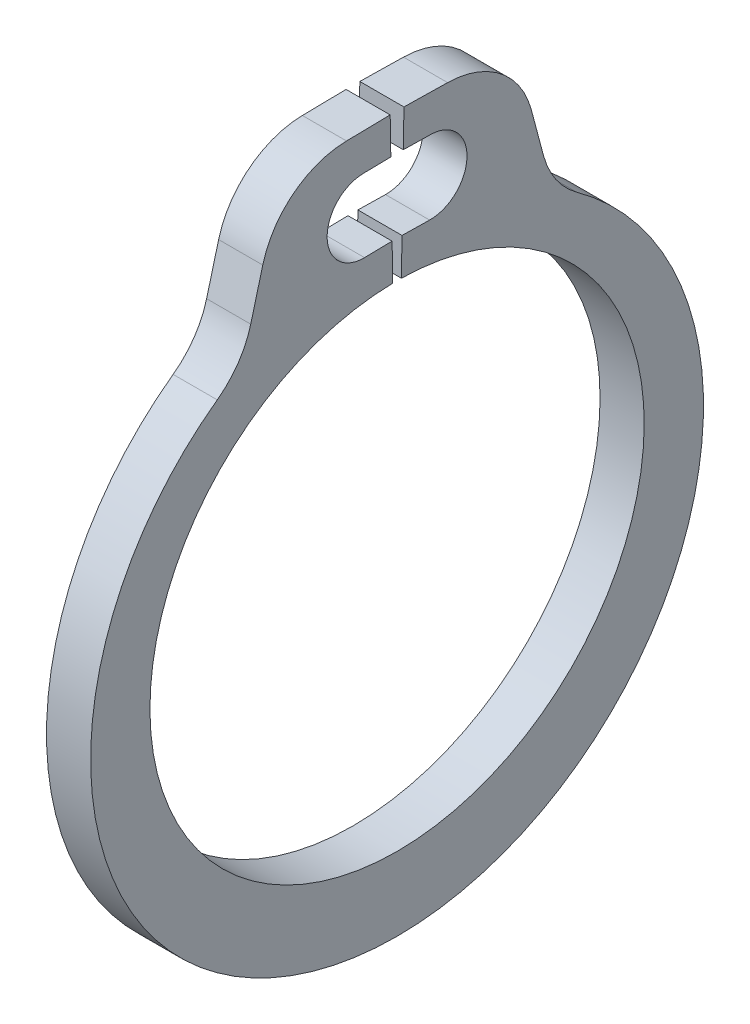
ISO-10303-21;
HEADER;
FILE_DESCRIPTION(('STEP AP214'),'2;1');
FILE_NAME('part.step','',(''),(''),'','','');
FILE_SCHEMA(('AUTOMOTIVE_DESIGN { 1 0 10303 214 1 1 1 1 }'));
ENDSEC;
DATA;
#1=APPLICATION_CONTEXT('core data for automotive mechanical design processes');
#2=APPLICATION_PROTOCOL_DEFINITION('international standard','automotive_design',2000,#1);
#3=PRODUCT_CONTEXT('',#1,'mechanical');
#4=PRODUCT('Part','Part','',(#3));
#5=PRODUCT_RELATED_PRODUCT_CATEGORY('part','',(#4));
#6=PRODUCT_DEFINITION_FORMATION('','',#4);
#7=PRODUCT_DEFINITION_CONTEXT('part definition',#1,'design');
#8=PRODUCT_DEFINITION('design','',#6,#7);
#9=PRODUCT_DEFINITION_SHAPE('','',#8);
#10=(LENGTH_UNIT() NAMED_UNIT(*) SI_UNIT(.MILLI.,.METRE.));
#11=(NAMED_UNIT(*) PLANE_ANGLE_UNIT() SI_UNIT($,.RADIAN.));
#12=(NAMED_UNIT(*) SI_UNIT($,.STERADIAN.) SOLID_ANGLE_UNIT());
#13=UNCERTAINTY_MEASURE_WITH_UNIT(LENGTH_MEASURE(1.E-05),#10,'distance_accuracy_value','');
#14=(GEOMETRIC_REPRESENTATION_CONTEXT(3) GLOBAL_UNCERTAINTY_ASSIGNED_CONTEXT((#13)) GLOBAL_UNIT_ASSIGNED_CONTEXT((#10,
#11,#12)) REPRESENTATION_CONTEXT('',''));
#15=CARTESIAN_POINT('',(0.,0.,0.));
#16=DIRECTION('',(0.,0.,1.));
#17=DIRECTION('',(1.,0.,0.));
#18=AXIS2_PLACEMENT_3D('',#15,#16,#17);
#19=CARTESIAN_POINT('',(0.1905,0.,0.));
#20=DIRECTION('',(-1.,0.,0.));
#21=DIRECTION('',(0.,0.,1.));
#22=AXIS2_PLACEMENT_3D('',#19,#20,#21);
#23=CYLINDRICAL_SURFACE('',#22,2.1336);
#24=CARTESIAN_POINT('',(-0.1905,0.,0.));
#25=DIRECTION('',(-1.,0.,0.));
#26=DIRECTION('',(0.,0.,-1.));
#27=AXIS2_PLACEMENT_3D('',#24,#25,#26);
#28=CIRCLE('',#27,2.1336);
#29=CARTESIAN_POINT('',(-0.1905,2.13327504238568,-0.0372364543745881));
#30=VERTEX_POINT('',#29);
#31=CARTESIAN_POINT('',(-0.1905,2.13327504238568,0.0372364543745881));
#32=VERTEX_POINT('',#31);
#33=EDGE_CURVE('E196',#30,#32,#28,.T.);
#34=ORIENTED_EDGE('',*,*,#33,.T.);
#35=DIRECTION('',(-1.,0.,0.));
#36=VECTOR('',#35,1.);
#37=CARTESIAN_POINT('',(0.1905,2.13327504238568,0.0372364543745881));
#38=LINE('',#37,#36);
#39=CARTESIAN_POINT('',(0.1905,2.13327504238568,0.0372364543745881));
#40=VERTEX_POINT('',#39);
#41=EDGE_CURVE('E178',#40,#32,#38,.T.);
#42=ORIENTED_EDGE('',*,*,#41,.F.);
#43=CARTESIAN_POINT('',(0.1905,0.,0.));
#44=DIRECTION('',(-1.,0.,0.));
#45=DIRECTION('',(0.,0.,-1.));
#46=AXIS2_PLACEMENT_3D('',#43,#44,#45);
#47=CIRCLE('',#46,2.1336);
#48=CARTESIAN_POINT('',(0.1905,2.13327504238568,-0.0372364543745881));
#49=VERTEX_POINT('',#48);
#50=EDGE_CURVE('E184',#49,#40,#47,.T.);
#51=ORIENTED_EDGE('',*,*,#50,.F.);
#52=DIRECTION('',(-1.,0.,0.));
#53=VECTOR('',#52,1.);
#54=CARTESIAN_POINT('',(0.1905,2.13327504238568,-0.0372364543745881));
#55=LINE('',#54,#53);
#56=EDGE_CURVE('E274',#49,#30,#55,.T.);
#57=ORIENTED_EDGE('',*,*,#56,.T.);
#58=EDGE_LOOP('',(#34,#42,#51,#57));
#59=FACE_BOUND('',#58,.T.);
#60=ADVANCED_FACE('F35',(#59),#23,.F.);
#61=CARTESIAN_POINT('',(0.1905,2.45072668559783,0.0427775934184257));
#62=DIRECTION('',(0.,-0.0174524064372838,0.999847695156391));
#63=DIRECTION('',(0.,-0.999847695156391,-0.0174524064372838));
#64=AXIS2_PLACEMENT_3D('',#61,#62,#63);
#65=PLANE('',#64);
#66=DIRECTION('',(0.,0.999847695156391,0.0174524064372838));
#67=VECTOR('',#66,1.);
#68=CARTESIAN_POINT('',(-0.1905,2.45072668559783,0.0427775934184257));
#69=LINE('',#68,#67);
#70=CARTESIAN_POINT('',(-0.1905,2.45072668559783,0.0427775934184257));
#71=VERTEX_POINT('',#70);
#72=EDGE_CURVE('E276',#32,#71,#69,.T.);
#73=ORIENTED_EDGE('',*,*,#72,.T.);
#74=DIRECTION('',(-1.,0.,0.));
#75=VECTOR('',#74,1.);
#76=CARTESIAN_POINT('',(0.1905,2.45072668559783,0.0427775934184257));
#77=LINE('',#76,#75);
#78=CARTESIAN_POINT('',(0.1905,2.45072668559783,0.0427775934184257));
#79=VERTEX_POINT('',#78);
#80=EDGE_CURVE('E181',#79,#71,#77,.T.);
#81=ORIENTED_EDGE('',*,*,#80,.F.);
#82=DIRECTION('',(0.,0.999847695156391,0.0174524064372838));
#83=VECTOR('',#82,1.);
#84=CARTESIAN_POINT('',(0.1905,2.45072668559783,0.0427775934184257));
#85=LINE('',#84,#83);
#86=EDGE_CURVE('E174',#40,#79,#85,.T.);
#87=ORIENTED_EDGE('',*,*,#86,.F.);
#88=ORIENTED_EDGE('',*,*,#41,.T.);
#89=EDGE_LOOP('',(#73,#81,#87,#88));
#90=FACE_BOUND('',#89,.T.);
#91=ADVANCED_FACE('F176',(#90),#65,.F.);
#92=CARTESIAN_POINT('',(0.1905,2.45072668559783,0.0427775934184257));
#93=DIRECTION('',(0.,-0.999847695156391,-0.0174524064372829));
#94=DIRECTION('',(0.,0.0174524064372829,-0.999847695156391));
#95=AXIS2_PLACEMENT_3D('',#92,#93,#94);
#96=PLANE('',#95);
#97=DIRECTION('',(0.,-0.0174524064372829,0.999847695156391));
#98=VECTOR('',#97,1.);
#99=CARTESIAN_POINT('',(-0.1905,2.45072668559783,0.0427775934184257));
#100=LINE('',#99,#98);
#101=CARTESIAN_POINT('',(-0.1905,2.44657083131495,0.280866325827541));
#102=VERTEX_POINT('',#101);
#103=EDGE_CURVE('E278',#71,#102,#100,.T.);
#104=ORIENTED_EDGE('',*,*,#103,.T.);
#105=DIRECTION('',(-1.,0.,0.));
#106=VECTOR('',#105,1.);
#107=CARTESIAN_POINT('',(0.1905,2.44657083131495,0.280866325827541));
#108=LINE('',#107,#106);
#109=CARTESIAN_POINT('',(0.1905,2.44657083131495,0.280866325827541));
#110=VERTEX_POINT('',#109);
#111=EDGE_CURVE('E201',#110,#102,#108,.T.);
#112=ORIENTED_EDGE('',*,*,#111,.F.);
#113=DIRECTION('',(0.,-0.0174524064372829,0.999847695156391));
#114=VECTOR('',#113,1.);
#115=CARTESIAN_POINT('',(0.1905,2.45072668559783,0.0427775934184257));
#116=LINE('',#115,#114);
#117=EDGE_CURVE('E183',#79,#110,#116,.T.);
#118=ORIENTED_EDGE('',*,*,#117,.F.);
#119=ORIENTED_EDGE('',*,*,#80,.T.);
#120=EDGE_LOOP('',(#104,#112,#118,#119));
#121=FACE_BOUND('',#120,.T.);
#122=ADVANCED_FACE('F380',(#121),#96,.F.);
#123=CARTESIAN_POINT('',(0.1905,2.76402247452711,0.286407464871378));
#124=DIRECTION('',(-1.,0.,0.));
#125=DIRECTION('',(0.,0.,1.));
#126=AXIS2_PLACEMENT_3D('',#123,#124,#125);
#127=CYLINDRICAL_SURFACE('',#126,0.3175);
#128=CARTESIAN_POINT('',(-0.1905,2.76402247452711,0.286407464871378));
#129=DIRECTION('',(-1.,0.,0.));
#130=DIRECTION('',(0.,0.,1.));
#131=AXIS2_PLACEMENT_3D('',#128,#129,#130);
#132=CIRCLE('',#131,0.3175);
#133=CARTESIAN_POINT('',(-0.1905,3.08147411773926,0.291948603915216));
#134=VERTEX_POINT('',#133);
#135=EDGE_CURVE('E280',#102,#134,#132,.T.);
#136=ORIENTED_EDGE('',*,*,#135,.T.);
#137=DIRECTION('',(-1.,0.,0.));
#138=VECTOR('',#137,1.);
#139=CARTESIAN_POINT('',(0.1905,3.08147411773926,0.291948603915216));
#140=LINE('',#139,#138);
#141=CARTESIAN_POINT('',(0.1905,3.08147411773926,0.291948603915216));
#142=VERTEX_POINT('',#141);
#143=EDGE_CURVE('E324',#142,#134,#140,.T.);
#144=ORIENTED_EDGE('',*,*,#143,.F.);
#145=CARTESIAN_POINT('',(0.1905,2.76402247452711,0.286407464871378));
#146=DIRECTION('',(-1.,0.,0.));
#147=DIRECTION('',(0.,0.,1.));
#148=AXIS2_PLACEMENT_3D('',#145,#146,#147);
#149=CIRCLE('',#148,0.3175);
#150=EDGE_CURVE('E333',#110,#142,#149,.T.);
#151=ORIENTED_EDGE('',*,*,#150,.F.);
#152=ORIENTED_EDGE('',*,*,#111,.T.);
#153=EDGE_LOOP('',(#136,#144,#151,#152));
#154=FACE_BOUND('',#153,.T.);
#155=ADVANCED_FACE('F331',(#154),#127,.F.);
#156=CARTESIAN_POINT('',(0.1905,3.08562997202214,0.0538598715061008));
#157=DIRECTION('',(0.,0.999847695156391,0.0174524064372829));
#158=DIRECTION('',(0.,-0.0174524064372829,0.999847695156391));
#159=AXIS2_PLACEMENT_3D('',#156,#157,#158);
#160=PLANE('',#159);
#161=DIRECTION('',(0.,0.0174524064372829,-0.999847695156391));
#162=VECTOR('',#161,1.);
#163=CARTESIAN_POINT('',(-0.1905,3.08562997202214,0.0538598715061008));
#164=LINE('',#163,#162);
#165=CARTESIAN_POINT('',(-0.1905,3.08562997202214,0.0538598715061008));
#166=VERTEX_POINT('',#165);
#167=EDGE_CURVE('E282',#134,#166,#164,.T.);
#168=ORIENTED_EDGE('',*,*,#167,.T.);
#169=DIRECTION('',(-1.,0.,0.));
#170=VECTOR('',#169,1.);
#171=CARTESIAN_POINT('',(0.1905,3.08562997202214,0.0538598715061008));
#172=LINE('',#171,#170);
#173=CARTESIAN_POINT('',(0.1905,3.08562997202214,0.0538598715061008));
#174=VERTEX_POINT('',#173);
#175=EDGE_CURVE('E321',#174,#166,#172,.T.);
#176=ORIENTED_EDGE('',*,*,#175,.F.);
#177=DIRECTION('',(0.,0.0174524064372829,-0.999847695156391));
#178=VECTOR('',#177,1.);
#179=CARTESIAN_POINT('',(0.1905,3.08562997202214,0.0538598715061008));
#180=LINE('',#179,#178);
#181=EDGE_CURVE('E349',#142,#174,#180,.T.);
#182=ORIENTED_EDGE('',*,*,#181,.F.);
#183=ORIENTED_EDGE('',*,*,#143,.T.);
#184=EDGE_LOOP('',(#168,#176,#182,#183));
#185=FACE_BOUND('',#184,.T.);
#186=ADVANCED_FACE('F341',(#185),#160,.F.);
#187=CARTESIAN_POINT('',(0.1905,3.08562997202214,0.0538598715061008));
#188=DIRECTION('',(0.,-0.0174524064372832,0.999847695156391));
#189=DIRECTION('',(0.,-0.999847695156391,-0.0174524064372832));
#190=AXIS2_PLACEMENT_3D('',#187,#188,#189);
#191=PLANE('',#190);
#192=DIRECTION('',(0.,0.999847695156391,0.0174524064372832));
#193=VECTOR('',#192,1.);
#194=CARTESIAN_POINT('',(-0.1905,3.08562997202214,0.0538598715061008));
#195=LINE('',#194,#193);
#196=CARTESIAN_POINT('',(-0.1905,3.40308161523429,0.0594010105499382));
#197=VERTEX_POINT('',#196);
#198=EDGE_CURVE('E284',#166,#197,#195,.T.);
#199=ORIENTED_EDGE('',*,*,#198,.T.);
#200=DIRECTION('',(-1.,0.,0.));
#201=VECTOR('',#200,1.);
#202=CARTESIAN_POINT('',(0.1905,3.40308161523429,0.0594010105499382));
#203=LINE('',#202,#201);
#204=CARTESIAN_POINT('',(0.1905,3.40308161523429,0.0594010105499382));
#205=VERTEX_POINT('',#204);
#206=EDGE_CURVE('E318',#205,#197,#203,.T.);
#207=ORIENTED_EDGE('',*,*,#206,.F.);
#208=DIRECTION('',(0.,0.999847695156391,0.0174524064372832));
#209=VECTOR('',#208,1.);
#210=CARTESIAN_POINT('',(0.1905,3.08562997202214,0.0538598715061008));
#211=LINE('',#210,#209);
#212=EDGE_CURVE('E347',#174,#205,#211,.T.);
#213=ORIENTED_EDGE('',*,*,#212,.F.);
#214=ORIENTED_EDGE('',*,*,#175,.T.);
#215=EDGE_LOOP('',(#199,#207,#213,#214));
#216=FACE_BOUND('',#215,.T.);
#217=ADVANCED_FACE('F345',(#216),#191,.F.);
#218=CARTESIAN_POINT('',(0.1905,3.40308161523429,0.0594010105499382));
#219=DIRECTION('',(0.,-0.999847695156391,-0.0174524064372833));
#220=DIRECTION('',(0.,0.0174524064372833,-0.999847695156391));
#221=AXIS2_PLACEMENT_3D('',#218,#219,#220);
#222=PLANE('',#221);
#223=DIRECTION('',(0.,-0.0174524064372833,0.999847695156391));
#224=VECTOR('',#223,1.);
#225=CARTESIAN_POINT('',(-0.1905,3.40308161523429,0.0594010105499382));
#226=LINE('',#225,#224);
#227=CARTESIAN_POINT('',(-0.1905,3.39650096805663,0.436406034863774));
#228=VERTEX_POINT('',#227);
#229=EDGE_CURVE('E286',#197,#228,#226,.T.);
#230=ORIENTED_EDGE('',*,*,#229,.T.);
#231=DIRECTION('',(-1.,0.,0.));
#232=VECTOR('',#231,1.);
#233=CARTESIAN_POINT('',(0.1905,3.39650096805663,0.436406034863774));
#234=LINE('',#233,#232);
#235=CARTESIAN_POINT('',(0.1905,3.39650096805663,0.436406034863774));
#236=VERTEX_POINT('',#235);
#237=EDGE_CURVE('E58',#228,#236,#234,.F.);
#238=ORIENTED_EDGE('',*,*,#237,.T.);
#239=DIRECTION('',(0.,-0.0174524064372833,0.999847695156391));
#240=VECTOR('',#239,1.);
#241=CARTESIAN_POINT('',(0.1905,3.40308161523429,0.0594010105499382));
#242=LINE('',#241,#240);
#243=EDGE_CURVE('E348',#205,#236,#242,.T.);
#244=ORIENTED_EDGE('',*,*,#243,.F.);
#245=ORIENTED_EDGE('',*,*,#206,.T.);
#246=EDGE_LOOP('',(#230,#238,#244,#245));
#247=FACE_BOUND('',#246,.T.);
#248=ADVANCED_FACE('F366',(#247),#222,.F.);
#249=CARTESIAN_POINT('',(0.1905,3.38645819810278,1.0117559401864));
#250=DIRECTION('',(0.,-0.256832135818306,-0.966456027975928));
#251=DIRECTION('',(0.,0.966456027975928,-0.256832135818306));
#252=AXIS2_PLACEMENT_3D('',#249,#250,#251);
#253=PLANE('',#252);
#254=DIRECTION('',(0.,-0.966456027975928,0.256832135818306));
#255=VECTOR('',#254,1.);
#256=CARTESIAN_POINT('',(-0.1905,3.38645819810278,1.0117559401864));
#257=LINE('',#256,#255);
#258=CARTESIAN_POINT('',(-0.1905,2.83032311184101,1.15954679447622));
#259=VERTEX_POINT('',#258);
#260=CARTESIAN_POINT('',(-0.1905,2.44016753972551,1.26322920318104));
#261=VERTEX_POINT('',#260);
#262=EDGE_CURVE('E248',#259,#261,#257,.T.);
#263=ORIENTED_EDGE('',*,*,#262,.T.);
#264=DIRECTION('',(1.,0.,0.));
#265=VECTOR('',#264,1.);
#266=CARTESIAN_POINT('',(0.1905,2.44016753972551,1.26322920318104));
#267=LINE('',#266,#265);
#268=CARTESIAN_POINT('',(0.1905,2.44016753972551,1.26322920318104));
#269=VERTEX_POINT('',#268);
#270=EDGE_CURVE('E210',#261,#269,#267,.T.);
#271=ORIENTED_EDGE('',*,*,#270,.T.);
#272=DIRECTION('',(0.,-0.966456027975928,0.256832135818306));
#273=VECTOR('',#272,1.);
#274=CARTESIAN_POINT('',(0.1905,3.38645819810278,1.0117559401864));
#275=LINE('',#274,#273);
#276=CARTESIAN_POINT('',(0.1905,2.83032311184101,1.15954679447622));
#277=VERTEX_POINT('',#276);
#278=EDGE_CURVE('E262',#277,#269,#275,.T.);
#279=ORIENTED_EDGE('',*,*,#278,.F.);
#280=DIRECTION('',(-1.,0.,0.));
#281=VECTOR('',#280,1.);
#282=CARTESIAN_POINT('',(0.1905,2.83032311184101,1.15954679447622));
#283=LINE('',#282,#281);
#284=EDGE_CURVE('E207',#277,#259,#283,.T.);
#285=ORIENTED_EDGE('',*,*,#284,.T.);
#286=EDGE_LOOP('',(#263,#271,#279,#285));
#287=FACE_BOUND('',#286,.T.);
#288=ADVANCED_FACE('F363',(#287),#253,.F.);
#289=CARTESIAN_POINT('',(0.1905,-0.123136153446836,0.));
#290=DIRECTION('',(-1.,0.,0.));
#291=DIRECTION('',(0.,0.,1.));
#292=AXIS2_PLACEMENT_3D('',#289,#290,#291);
#293=CYLINDRICAL_SURFACE('',#292,2.64546384655316);
#294=CARTESIAN_POINT('',(0.1905,-0.123136153446836,0.));
#295=DIRECTION('',(1.,0.,0.));
#296=DIRECTION('',(0.,0.,-1.));
#297=AXIS2_PLACEMENT_3D('',#294,#295,#296);
#298=CIRCLE('',#297,2.64546384655316);
#299=CARTESIAN_POINT('',(0.1905,2.01888528998576,1.55248932340766));
#300=VERTEX_POINT('',#299);
#301=CARTESIAN_POINT('',(0.1905,2.01888528998577,-1.55248932340766));
#302=VERTEX_POINT('',#301);
#303=EDGE_CURVE('E254',#300,#302,#298,.T.);
#304=ORIENTED_EDGE('',*,*,#303,.F.);
#305=DIRECTION('',(-1.,0.,0.));
#306=VECTOR('',#305,1.);
#307=CARTESIAN_POINT('',(0.1905,2.01888528998576,1.55248932340766));
#308=LINE('',#307,#306);
#309=CARTESIAN_POINT('',(-0.1905,2.01888528998576,1.55248932340766));
#310=VERTEX_POINT('',#309);
#311=EDGE_CURVE('E199',#300,#310,#308,.T.);
#312=ORIENTED_EDGE('',*,*,#311,.T.);
#313=CARTESIAN_POINT('',(-0.1905,-0.123136153446836,0.));
#314=DIRECTION('',(1.,0.,0.));
#315=DIRECTION('',(0.,0.,-1.));
#316=AXIS2_PLACEMENT_3D('',#313,#314,#315);
#317=CIRCLE('',#316,2.64546384655316);
#318=CARTESIAN_POINT('',(-0.1905,2.01888528998577,-1.55248932340766));
#319=VERTEX_POINT('',#318);
#320=EDGE_CURVE('E237',#310,#319,#317,.T.);
#321=ORIENTED_EDGE('',*,*,#320,.T.);
#322=DIRECTION('',(-1.,0.,0.));
#323=VECTOR('',#322,1.);
#324=CARTESIAN_POINT('',(0.1905,2.01888528998577,-1.55248932340766));
#325=LINE('',#324,#323);
#326=EDGE_CURVE('E197',#319,#302,#325,.F.);
#327=ORIENTED_EDGE('',*,*,#326,.T.);
#328=EDGE_LOOP('',(#304,#312,#321,#327));
#329=FACE_BOUND('',#328,.T.);
#330=ADVANCED_FACE('F245',(#329),#293,.T.);
#331=CARTESIAN_POINT('',(0.1905,3.38645819810278,-1.0117559401864));
#332=DIRECTION('',(0.,-0.256832135818306,0.966456027975928));
#333=DIRECTION('',(0.,-0.966456027975928,-0.256832135818306));
#334=AXIS2_PLACEMENT_3D('',#331,#332,#333);
#335=PLANE('',#334);
#336=DIRECTION('',(0.,0.966456027975928,0.256832135818306));
#337=VECTOR('',#336,1.);
#338=CARTESIAN_POINT('',(0.1905,3.38645819810278,-1.0117559401864));
#339=LINE('',#338,#337);
#340=CARTESIAN_POINT('',(0.1905,2.44016753972551,-1.26322920318104));
#341=VERTEX_POINT('',#340);
#342=CARTESIAN_POINT('',(0.1905,2.83032311184101,-1.15954679447622));
#343=VERTEX_POINT('',#342);
#344=EDGE_CURVE('E253',#341,#343,#339,.T.);
#345=ORIENTED_EDGE('',*,*,#344,.F.);
#346=DIRECTION('',(1.,0.,0.));
#347=VECTOR('',#346,1.);
#348=CARTESIAN_POINT('',(-0.1905,2.44016753972551,-1.26322920318104));
#349=LINE('',#348,#347);
#350=CARTESIAN_POINT('',(-0.1905,2.44016753972551,-1.26322920318104));
#351=VERTEX_POINT('',#350);
#352=EDGE_CURVE('E214',#341,#351,#349,.F.);
#353=ORIENTED_EDGE('',*,*,#352,.T.);
#354=DIRECTION('',(0.,0.966456027975928,0.256832135818306));
#355=VECTOR('',#354,1.);
#356=CARTESIAN_POINT('',(-0.1905,3.38645819810278,-1.0117559401864));
#357=LINE('',#356,#355);
#358=CARTESIAN_POINT('',(-0.1905,2.83032311184101,-1.15954679447622));
#359=VERTEX_POINT('',#358);
#360=EDGE_CURVE('E239',#351,#359,#357,.T.);
#361=ORIENTED_EDGE('',*,*,#360,.T.);
#362=DIRECTION('',(-1.,0.,0.));
#363=VECTOR('',#362,1.);
#364=CARTESIAN_POINT('',(0.1905,2.83032311184101,-1.15954679447622));
#365=LINE('',#364,#363);
#366=EDGE_CURVE('E212',#359,#343,#365,.F.);
#367=ORIENTED_EDGE('',*,*,#366,.T.);
#368=EDGE_LOOP('',(#345,#353,#361,#367));
#369=FACE_BOUND('',#368,.T.);
#370=ADVANCED_FACE('F256',(#369),#335,.F.);
#371=CARTESIAN_POINT('',(0.1905,3.40308161523429,-0.0594010105499382));
#372=DIRECTION('',(0.,-0.999847695156391,0.0174524064372829));
#373=DIRECTION('',(0.,-0.0174524064372829,-0.999847695156391));
#374=AXIS2_PLACEMENT_3D('',#371,#372,#373);
#375=PLANE('',#374);
#376=DIRECTION('',(0.,0.0174524064372829,0.999847695156391));
#377=VECTOR('',#376,1.);
#378=CARTESIAN_POINT('',(0.1905,3.40308161523429,-0.0594010105499382));
#379=LINE('',#378,#377);
#380=CARTESIAN_POINT('',(0.1905,3.39650096805663,-0.436406034863773));
#381=VERTEX_POINT('',#380);
#382=CARTESIAN_POINT('',(0.1905,3.40308161523429,-0.0594010105499382));
#383=VERTEX_POINT('',#382);
#384=EDGE_CURVE('E258',#381,#383,#379,.T.);
#385=ORIENTED_EDGE('',*,*,#384,.F.);
#386=DIRECTION('',(-1.,0.,0.));
#387=VECTOR('',#386,1.);
#388=CARTESIAN_POINT('',(0.1905,3.39650096805663,-0.436406034863773));
#389=LINE('',#388,#387);
#390=CARTESIAN_POINT('',(-0.1905,3.39650096805663,-0.436406034863773));
#391=VERTEX_POINT('',#390);
#392=EDGE_CURVE('E225',#381,#391,#389,.T.);
#393=ORIENTED_EDGE('',*,*,#392,.T.);
#394=DIRECTION('',(0.,0.0174524064372829,0.999847695156391));
#395=VECTOR('',#394,1.);
#396=CARTESIAN_POINT('',(-0.1905,3.40308161523429,-0.0594010105499382));
#397=LINE('',#396,#395);
#398=CARTESIAN_POINT('',(-0.1905,3.40308161523429,-0.0594010105499382));
#399=VERTEX_POINT('',#398);
#400=EDGE_CURVE('E291',#391,#399,#397,.T.);
#401=ORIENTED_EDGE('',*,*,#400,.T.);
#402=DIRECTION('',(-1.,0.,0.));
#403=VECTOR('',#402,1.);
#404=CARTESIAN_POINT('',(0.1905,3.40308161523429,-0.0594010105499382));
#405=LINE('',#404,#403);
#406=EDGE_CURVE('E315',#383,#399,#405,.T.);
#407=ORIENTED_EDGE('',*,*,#406,.F.);
#408=EDGE_LOOP('',(#385,#393,#401,#407));
#409=FACE_BOUND('',#408,.T.);
#410=ADVANCED_FACE('F397',(#409),#375,.F.);
#411=CARTESIAN_POINT('',(0.1905,3.08562997202214,-0.0538598715061008));
#412=DIRECTION('',(0.,-0.0174524064372832,-0.999847695156391));
#413=DIRECTION('',(0.,0.999847695156391,-0.0174524064372832));
#414=AXIS2_PLACEMENT_3D('',#411,#412,#413);
#415=PLANE('',#414);
#416=DIRECTION('',(0.,-0.999847695156391,0.0174524064372832));
#417=VECTOR('',#416,1.);
#418=CARTESIAN_POINT('',(-0.1905,3.08562997202214,-0.0538598715061008));
#419=LINE('',#418,#417);
#420=CARTESIAN_POINT('',(-0.1905,3.08562997202214,-0.0538598715061008));
#421=VERTEX_POINT('',#420);
#422=EDGE_CURVE('E293',#399,#421,#419,.T.);
#423=ORIENTED_EDGE('',*,*,#422,.T.);
#424=DIRECTION('',(-1.,0.,0.));
#425=VECTOR('',#424,1.);
#426=CARTESIAN_POINT('',(0.1905,3.08562997202214,-0.0538598715061008));
#427=LINE('',#426,#425);
#428=CARTESIAN_POINT('',(0.1905,3.08562997202214,-0.0538598715061008));
#429=VERTEX_POINT('',#428);
#430=EDGE_CURVE('E312',#429,#421,#427,.T.);
#431=ORIENTED_EDGE('',*,*,#430,.F.);
#432=DIRECTION('',(0.,-0.999847695156391,0.0174524064372832));
#433=VECTOR('',#432,1.);
#434=CARTESIAN_POINT('',(0.1905,3.08562997202214,-0.0538598715061008));
#435=LINE('',#434,#433);
#436=EDGE_CURVE('E260',#383,#429,#435,.T.);
#437=ORIENTED_EDGE('',*,*,#436,.F.);
#438=ORIENTED_EDGE('',*,*,#406,.T.);
#439=EDGE_LOOP('',(#423,#431,#437,#438));
#440=FACE_BOUND('',#439,.T.);
#441=ADVANCED_FACE('F404',(#440),#415,.F.);
#442=CARTESIAN_POINT('',(0.1905,3.08562997202214,-0.0538598715061008));
#443=DIRECTION('',(0.,0.999847695156391,-0.0174524064372829));
#444=DIRECTION('',(0.,0.0174524064372829,0.999847695156391));
#445=AXIS2_PLACEMENT_3D('',#442,#443,#444);
#446=PLANE('',#445);
#447=DIRECTION('',(0.,-0.0174524064372829,-0.999847695156391));
#448=VECTOR('',#447,1.);
#449=CARTESIAN_POINT('',(-0.1905,3.08562997202214,-0.0538598715061008));
#450=LINE('',#449,#448);
#451=CARTESIAN_POINT('',(-0.1905,3.08147411773926,-0.291948603915216));
#452=VERTEX_POINT('',#451);
#453=EDGE_CURVE('E295',#421,#452,#450,.T.);
#454=ORIENTED_EDGE('',*,*,#453,.T.);
#455=DIRECTION('',(-1.,0.,0.));
#456=VECTOR('',#455,1.);
#457=CARTESIAN_POINT('',(0.1905,3.08147411773926,-0.291948603915216));
#458=LINE('',#457,#456);
#459=CARTESIAN_POINT('',(0.1905,3.08147411773926,-0.291948603915216));
#460=VERTEX_POINT('',#459);
#461=EDGE_CURVE('E309',#460,#452,#458,.T.);
#462=ORIENTED_EDGE('',*,*,#461,.F.);
#463=DIRECTION('',(0.,-0.0174524064372829,-0.999847695156391));
#464=VECTOR('',#463,1.);
#465=CARTESIAN_POINT('',(0.1905,3.08562997202214,-0.0538598715061008));
#466=LINE('',#465,#464);
#467=EDGE_CURVE('E267',#429,#460,#466,.T.);
#468=ORIENTED_EDGE('',*,*,#467,.F.);
#469=ORIENTED_EDGE('',*,*,#430,.T.);
#470=EDGE_LOOP('',(#454,#462,#468,#469));
#471=FACE_BOUND('',#470,.T.);
#472=ADVANCED_FACE('F408',(#471),#446,.F.);
#473=CARTESIAN_POINT('',(0.1905,2.76402247452711,-0.286407464871378));
#474=DIRECTION('',(-1.,0.,0.));
#475=DIRECTION('',(0.,0.,1.));
#476=AXIS2_PLACEMENT_3D('',#473,#474,#475);
#477=CYLINDRICAL_SURFACE('',#476,0.3175);
#478=CARTESIAN_POINT('',(-0.1905,2.76402247452711,-0.286407464871378));
#479=DIRECTION('',(-1.,0.,0.));
#480=DIRECTION('',(0.,0.,-1.));
#481=AXIS2_PLACEMENT_3D('',#478,#479,#480);
#482=CIRCLE('',#481,0.3175);
#483=CARTESIAN_POINT('',(-0.1905,2.44657083131495,-0.280866325827541));
#484=VERTEX_POINT('',#483);
#485=EDGE_CURVE('E297',#452,#484,#482,.T.);
#486=ORIENTED_EDGE('',*,*,#485,.T.);
#487=DIRECTION('',(-1.,0.,0.));
#488=VECTOR('',#487,1.);
#489=CARTESIAN_POINT('',(0.1905,2.44657083131495,-0.280866325827541));
#490=LINE('',#489,#488);
#491=CARTESIAN_POINT('',(0.1905,2.44657083131495,-0.280866325827541));
#492=VERTEX_POINT('',#491);
#493=EDGE_CURVE('E306',#492,#484,#490,.T.);
#494=ORIENTED_EDGE('',*,*,#493,.F.);
#495=CARTESIAN_POINT('',(0.1905,2.76402247452711,-0.286407464871378));
#496=DIRECTION('',(-1.,0.,0.));
#497=DIRECTION('',(0.,0.,-1.));
#498=AXIS2_PLACEMENT_3D('',#495,#496,#497);
#499=CIRCLE('',#498,0.3175);
#500=EDGE_CURVE('E269',#460,#492,#499,.T.);
#501=ORIENTED_EDGE('',*,*,#500,.F.);
#502=ORIENTED_EDGE('',*,*,#461,.T.);
#503=EDGE_LOOP('',(#486,#494,#501,#502));
#504=FACE_BOUND('',#503,.T.);
#505=ADVANCED_FACE('F415',(#504),#477,.F.);
#506=CARTESIAN_POINT('',(0.1905,2.45072668559783,-0.0427775934184257));
#507=DIRECTION('',(0.,-0.999847695156391,0.0174524064372829));
#508=DIRECTION('',(0.,-0.0174524064372829,-0.999847695156391));
#509=AXIS2_PLACEMENT_3D('',#506,#507,#508);
#510=PLANE('',#509);
#511=DIRECTION('',(0.,0.0174524064372829,0.999847695156391));
#512=VECTOR('',#511,1.);
#513=CARTESIAN_POINT('',(-0.1905,2.45072668559783,-0.0427775934184257));
#514=LINE('',#513,#512);
#515=CARTESIAN_POINT('',(-0.1905,2.45072668559783,-0.0427775934184257));
#516=VERTEX_POINT('',#515);
#517=EDGE_CURVE('E299',#484,#516,#514,.T.);
#518=ORIENTED_EDGE('',*,*,#517,.T.);
#519=DIRECTION('',(-1.,0.,0.));
#520=VECTOR('',#519,1.);
#521=CARTESIAN_POINT('',(0.1905,2.45072668559783,-0.0427775934184257));
#522=LINE('',#521,#520);
#523=CARTESIAN_POINT('',(0.1905,2.45072668559783,-0.0427775934184257));
#524=VERTEX_POINT('',#523);
#525=EDGE_CURVE('E303',#524,#516,#522,.T.);
#526=ORIENTED_EDGE('',*,*,#525,.F.);
#527=DIRECTION('',(0.,0.0174524064372829,0.999847695156391));
#528=VECTOR('',#527,1.);
#529=CARTESIAN_POINT('',(0.1905,2.45072668559783,-0.0427775934184257));
#530=LINE('',#529,#528);
#531=EDGE_CURVE('E271',#492,#524,#530,.T.);
#532=ORIENTED_EDGE('',*,*,#531,.F.);
#533=ORIENTED_EDGE('',*,*,#493,.T.);
#534=EDGE_LOOP('',(#518,#526,#532,#533));
#535=FACE_BOUND('',#534,.T.);
#536=ADVANCED_FACE('F418',(#535),#510,.F.);
#537=CARTESIAN_POINT('',(0.1905,2.45072668559783,-0.0427775934184257));
#538=DIRECTION('',(0.,-0.0174524064372838,-0.999847695156391));
#539=DIRECTION('',(0.,0.999847695156391,-0.0174524064372838));
#540=AXIS2_PLACEMENT_3D('',#537,#538,#539);
#541=PLANE('',#540);
#542=DIRECTION('',(0.,-0.999847695156391,0.0174524064372838));
#543=VECTOR('',#542,1.);
#544=CARTESIAN_POINT('',(-0.1905,2.45072668559783,-0.0427775934184257));
#545=LINE('',#544,#543);
#546=EDGE_CURVE('E193',#516,#30,#545,.T.);
#547=ORIENTED_EDGE('',*,*,#546,.T.);
#548=ORIENTED_EDGE('',*,*,#56,.F.);
#549=DIRECTION('',(0.,-0.999847695156391,0.0174524064372838));
#550=VECTOR('',#549,1.);
#551=CARTESIAN_POINT('',(0.1905,2.45072668559783,-0.0427775934184257));
#552=LINE('',#551,#550);
#553=EDGE_CURVE('E189',#524,#49,#552,.T.);
#554=ORIENTED_EDGE('',*,*,#553,.F.);
#555=ORIENTED_EDGE('',*,*,#525,.T.);
#556=EDGE_LOOP('',(#547,#548,#554,#555));
#557=FACE_BOUND('',#556,.T.);
#558=ADVANCED_FACE('F421',(#557),#541,.F.);
#559=CARTESIAN_POINT('',(0.1905,0.,0.));
#560=DIRECTION('',(1.,0.,0.));
#561=DIRECTION('',(0.,0.,-1.));
#562=AXIS2_PLACEMENT_3D('',#559,#560,#561);
#563=PLANE('',#562);
#564=ORIENTED_EDGE('',*,*,#243,.T.);
#565=CARTESIAN_POINT('',(0.1905,2.63461702434746,0.423107301158564));
#566=DIRECTION('',(1.,0.,0.));
#567=DIRECTION('',(0.,0.,-1.));
#568=AXIS2_PLACEMENT_3D('',#565,#566,#567);
#569=CIRCLE('',#568,0.762);
#570=EDGE_CURVE('E223',#236,#277,#569,.T.);
#571=ORIENTED_EDGE('',*,*,#570,.T.);
#572=ORIENTED_EDGE('',*,*,#278,.T.);
#573=CARTESIAN_POINT('',(0.1905,2.63587362721906,1.9996686964987));
#574=DIRECTION('',(1.,0.,0.));
#575=DIRECTION('',(0.,0.,-1.));
#576=AXIS2_PLACEMENT_3D('',#573,#574,#575);
#577=CIRCLE('',#576,0.762);
#578=EDGE_CURVE('E230',#269,#300,#577,.F.);
#579=ORIENTED_EDGE('',*,*,#578,.T.);
#580=ORIENTED_EDGE('',*,*,#303,.T.);
#581=CARTESIAN_POINT('',(0.1905,2.63587362721906,-1.9996686964987));
#582=DIRECTION('',(1.,0.,0.));
#583=DIRECTION('',(0.,0.,-1.));
#584=AXIS2_PLACEMENT_3D('',#581,#582,#583);
#585=CIRCLE('',#584,0.762);
#586=EDGE_CURVE('E11',#302,#341,#585,.F.);
#587=ORIENTED_EDGE('',*,*,#586,.T.);
#588=ORIENTED_EDGE('',*,*,#344,.T.);
#589=CARTESIAN_POINT('',(0.1905,2.63461702434746,-0.423107301158564));
#590=DIRECTION('',(1.,0.,0.));
#591=DIRECTION('',(0.,0.,-1.));
#592=AXIS2_PLACEMENT_3D('',#589,#590,#591);
#593=CIRCLE('',#592,0.762);
#594=EDGE_CURVE('E50',#343,#381,#593,.T.);
#595=ORIENTED_EDGE('',*,*,#594,.T.);
#596=ORIENTED_EDGE('',*,*,#384,.T.);
#597=ORIENTED_EDGE('',*,*,#436,.T.);
#598=ORIENTED_EDGE('',*,*,#467,.T.);
#599=ORIENTED_EDGE('',*,*,#500,.T.);
#600=ORIENTED_EDGE('',*,*,#531,.T.);
#601=ORIENTED_EDGE('',*,*,#553,.T.);
#602=ORIENTED_EDGE('',*,*,#50,.T.);
#603=ORIENTED_EDGE('',*,*,#86,.T.);
#604=ORIENTED_EDGE('',*,*,#117,.T.);
#605=ORIENTED_EDGE('',*,*,#150,.T.);
#606=ORIENTED_EDGE('',*,*,#181,.T.);
#607=ORIENTED_EDGE('',*,*,#212,.T.);
#608=EDGE_LOOP('',(#564,#571,#572,#579,#580,#587,#588,#595,#596,#597,#598,#599,#600,#601,#602,
#603,#604,#605,#606,#607));
#609=FACE_BOUND('',#608,.T.);
#610=ADVANCED_FACE('F187',(#609),#563,.T.);
#611=CARTESIAN_POINT('',(-0.1905,0.,0.));
#612=DIRECTION('',(1.,0.,0.));
#613=DIRECTION('',(0.,0.,-1.));
#614=AXIS2_PLACEMENT_3D('',#611,#612,#613);
#615=PLANE('',#614);
#616=ORIENTED_EDGE('',*,*,#262,.F.);
#617=CARTESIAN_POINT('',(-0.1905,2.63461702434746,0.423107301158564));
#618=DIRECTION('',(1.,0.,0.));
#619=DIRECTION('',(0.,0.,-1.));
#620=AXIS2_PLACEMENT_3D('',#617,#618,#619);
#621=CIRCLE('',#620,0.762);
#622=EDGE_CURVE('E219',#259,#228,#621,.F.);
#623=ORIENTED_EDGE('',*,*,#622,.T.);
#624=ORIENTED_EDGE('',*,*,#229,.F.);
#625=ORIENTED_EDGE('',*,*,#198,.F.);
#626=ORIENTED_EDGE('',*,*,#167,.F.);
#627=ORIENTED_EDGE('',*,*,#135,.F.);
#628=ORIENTED_EDGE('',*,*,#103,.F.);
#629=ORIENTED_EDGE('',*,*,#72,.F.);
#630=ORIENTED_EDGE('',*,*,#33,.F.);
#631=ORIENTED_EDGE('',*,*,#546,.F.);
#632=ORIENTED_EDGE('',*,*,#517,.F.);
#633=ORIENTED_EDGE('',*,*,#485,.F.);
#634=ORIENTED_EDGE('',*,*,#453,.F.);
#635=ORIENTED_EDGE('',*,*,#422,.F.);
#636=ORIENTED_EDGE('',*,*,#400,.F.);
#637=CARTESIAN_POINT('',(-0.1905,2.63461702434746,-0.423107301158564));
#638=DIRECTION('',(1.,0.,0.));
#639=DIRECTION('',(0.,0.,-1.));
#640=AXIS2_PLACEMENT_3D('',#637,#638,#639);
#641=CIRCLE('',#640,0.762);
#642=EDGE_CURVE('E217',#391,#359,#641,.F.);
#643=ORIENTED_EDGE('',*,*,#642,.T.);
#644=ORIENTED_EDGE('',*,*,#360,.F.);
#645=CARTESIAN_POINT('',(-0.1905,2.63587362721906,-1.9996686964987));
#646=DIRECTION('',(1.,0.,0.));
#647=DIRECTION('',(0.,0.,-1.));
#648=AXIS2_PLACEMENT_3D('',#645,#646,#647);
#649=CIRCLE('',#648,0.762);
#650=EDGE_CURVE('E43',#351,#319,#649,.T.);
#651=ORIENTED_EDGE('',*,*,#650,.T.);
#652=ORIENTED_EDGE('',*,*,#320,.F.);
#653=CARTESIAN_POINT('',(-0.1905,2.63587362721906,1.9996686964987));
#654=DIRECTION('',(1.,0.,0.));
#655=DIRECTION('',(0.,0.,-1.));
#656=AXIS2_PLACEMENT_3D('',#653,#654,#655);
#657=CIRCLE('',#656,0.762);
#658=EDGE_CURVE('E228',#310,#261,#657,.T.);
#659=ORIENTED_EDGE('',*,*,#658,.T.);
#660=EDGE_LOOP('',(#616,#623,#624,#625,#626,#627,#628,#629,#630,#631,#632,#633,#634,#635,#636,
#643,#644,#651,#652,#659));
#661=FACE_BOUND('',#660,.T.);
#662=ADVANCED_FACE('F236',(#661),#615,.F.);
#663=CARTESIAN_POINT('',(0.1905,2.63587362721906,1.9996686964987));
#664=DIRECTION('',(-1.,0.,0.));
#665=DIRECTION('',(0.,0.,1.));
#666=AXIS2_PLACEMENT_3D('',#663,#664,#665);
#667=CYLINDRICAL_SURFACE('',#666,0.762);
#668=ORIENTED_EDGE('',*,*,#578,.F.);
#669=ORIENTED_EDGE('',*,*,#270,.F.);
#670=ORIENTED_EDGE('',*,*,#658,.F.);
#671=ORIENTED_EDGE('',*,*,#311,.F.);
#672=EDGE_LOOP('',(#668,#669,#670,#671));
#673=FACE_BOUND('',#672,.T.);
#674=ADVANCED_FACE('F362',(#673),#667,.F.);
#675=CARTESIAN_POINT('',(0.1905,2.63587362721906,-1.9996686964987));
#676=DIRECTION('',(-1.,0.,0.));
#677=DIRECTION('',(0.,0.,1.));
#678=AXIS2_PLACEMENT_3D('',#675,#676,#677);
#679=CYLINDRICAL_SURFACE('',#678,0.762);
#680=ORIENTED_EDGE('',*,*,#586,.F.);
#681=ORIENTED_EDGE('',*,*,#326,.F.);
#682=ORIENTED_EDGE('',*,*,#650,.F.);
#683=ORIENTED_EDGE('',*,*,#352,.F.);
#684=EDGE_LOOP('',(#680,#681,#682,#683));
#685=FACE_BOUND('',#684,.T.);
#686=ADVANCED_FACE('F251',(#685),#679,.F.);
#687=CARTESIAN_POINT('',(0.1905,2.63461702434746,0.423107301158564));
#688=DIRECTION('',(-1.,0.,0.));
#689=DIRECTION('',(0.,0.,1.));
#690=AXIS2_PLACEMENT_3D('',#687,#688,#689);
#691=CYLINDRICAL_SURFACE('',#690,0.762);
#692=ORIENTED_EDGE('',*,*,#570,.F.);
#693=ORIENTED_EDGE('',*,*,#237,.F.);
#694=ORIENTED_EDGE('',*,*,#622,.F.);
#695=ORIENTED_EDGE('',*,*,#284,.F.);
#696=EDGE_LOOP('',(#692,#693,#694,#695));
#697=FACE_BOUND('',#696,.T.);
#698=ADVANCED_FACE('F365',(#697),#691,.T.);
#699=CARTESIAN_POINT('',(0.1905,2.63461702434746,-0.423107301158564));
#700=DIRECTION('',(-1.,0.,0.));
#701=DIRECTION('',(0.,0.,1.));
#702=AXIS2_PLACEMENT_3D('',#699,#700,#701);
#703=CYLINDRICAL_SURFACE('',#702,0.762);
#704=ORIENTED_EDGE('',*,*,#594,.F.);
#705=ORIENTED_EDGE('',*,*,#366,.F.);
#706=ORIENTED_EDGE('',*,*,#642,.F.);
#707=ORIENTED_EDGE('',*,*,#392,.F.);
#708=EDGE_LOOP('',(#704,#705,#706,#707));
#709=FACE_BOUND('',#708,.T.);
#710=ADVANCED_FACE('F37',(#709),#703,.T.);
#711=CLOSED_SHELL('',(#60,#91,#122,#155,#186,#217,#248,#288,#330,#370,#410,#441,#472,#505,#536,
#558,#610,#662,#674,#686,#698,#710));
#712=MANIFOLD_SOLID_BREP('B2',#711);
#713=ADVANCED_BREP_SHAPE_REPRESENTATION('',(#18,#712),#14);
#714=SHAPE_DEFINITION_REPRESENTATION(#9,#713);
ENDSEC;
END-ISO-10303-21;
